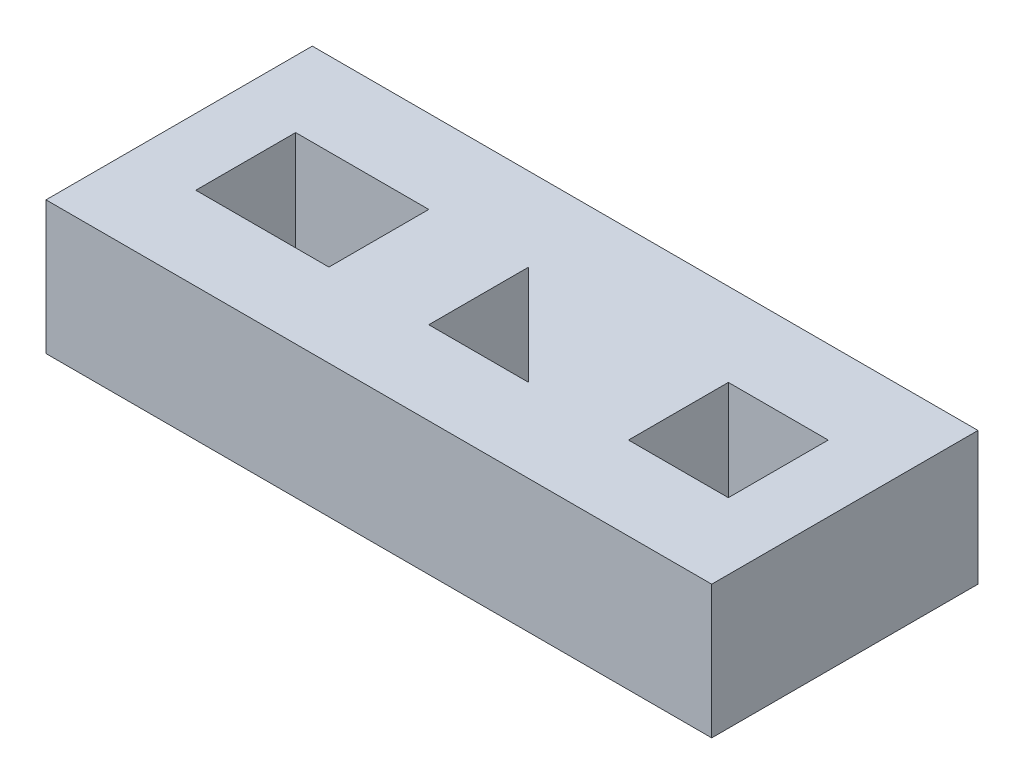
ISO-10303-21;
HEADER;
FILE_DESCRIPTION(('STEP AP214'),'2;1');
FILE_NAME('part.step','',(''),(''),'','','');
FILE_SCHEMA(('AUTOMOTIVE_DESIGN { 1 0 10303 214 1 1 1 1 }'));
ENDSEC;
DATA;
#1=APPLICATION_CONTEXT('core data for automotive mechanical design processes');
#2=APPLICATION_PROTOCOL_DEFINITION('international standard','automotive_design',2000,#1);
#3=PRODUCT_CONTEXT('',#1,'mechanical');
#4=PRODUCT('Part','Part','',(#3));
#5=PRODUCT_RELATED_PRODUCT_CATEGORY('part','',(#4));
#6=PRODUCT_DEFINITION_FORMATION('','',#4);
#7=PRODUCT_DEFINITION_CONTEXT('part definition',#1,'design');
#8=PRODUCT_DEFINITION('design','',#6,#7);
#9=PRODUCT_DEFINITION_SHAPE('','',#8);
#10=(LENGTH_UNIT() NAMED_UNIT(*) SI_UNIT(.MILLI.,.METRE.));
#11=(NAMED_UNIT(*) PLANE_ANGLE_UNIT() SI_UNIT($,.RADIAN.));
#12=(NAMED_UNIT(*) SI_UNIT($,.STERADIAN.) SOLID_ANGLE_UNIT());
#13=UNCERTAINTY_MEASURE_WITH_UNIT(LENGTH_MEASURE(1.E-05),#10,'distance_accuracy_value','');
#14=(GEOMETRIC_REPRESENTATION_CONTEXT(3) GLOBAL_UNCERTAINTY_ASSIGNED_CONTEXT((#13)) GLOBAL_UNIT_ASSIGNED_CONTEXT((#10,
#11,#12)) REPRESENTATION_CONTEXT('',''));
#15=CARTESIAN_POINT('',(0.,0.,0.));
#16=DIRECTION('',(0.,0.,1.));
#17=DIRECTION('',(1.,0.,0.));
#18=AXIS2_PLACEMENT_3D('',#15,#16,#17);
#19=CARTESIAN_POINT('',(0.,25.4,0.));
#20=DIRECTION('',(1.,0.,0.));
#21=DIRECTION('',(0.,0.,-1.));
#22=AXIS2_PLACEMENT_3D('',#19,#20,#21);
#23=PLANE('',#22);
#24=DIRECTION('',(0.,0.,1.));
#25=VECTOR('',#24,1.);
#26=CARTESIAN_POINT('',(0.,0.,0.));
#27=LINE('',#26,#25);
#28=CARTESIAN_POINT('',(0.,0.,-50.8));
#29=VERTEX_POINT('',#28);
#30=CARTESIAN_POINT('',(0.,0.,0.));
#31=VERTEX_POINT('',#30);
#32=EDGE_CURVE('E224',#29,#31,#27,.T.);
#33=ORIENTED_EDGE('',*,*,#32,.T.);
#34=DIRECTION('',(0.,-1.,0.));
#35=VECTOR('',#34,1.);
#36=CARTESIAN_POINT('',(0.,25.4,0.));
#37=LINE('',#36,#35);
#38=CARTESIAN_POINT('',(0.,25.4,0.));
#39=VERTEX_POINT('',#38);
#40=EDGE_CURVE('E11',#39,#31,#37,.T.);
#41=ORIENTED_EDGE('',*,*,#40,.F.);
#42=DIRECTION('',(0.,0.,1.));
#43=VECTOR('',#42,1.);
#44=CARTESIAN_POINT('',(0.,25.4,0.));
#45=LINE('',#44,#43);
#46=CARTESIAN_POINT('',(0.,25.4,-50.8));
#47=VERTEX_POINT('',#46);
#48=EDGE_CURVE('E231',#47,#39,#45,.T.);
#49=ORIENTED_EDGE('',*,*,#48,.F.);
#50=DIRECTION('',(0.,-1.,0.));
#51=VECTOR('',#50,1.);
#52=CARTESIAN_POINT('',(0.,25.4,-50.8));
#53=LINE('',#52,#51);
#54=EDGE_CURVE('E241',#47,#29,#53,.T.);
#55=ORIENTED_EDGE('',*,*,#54,.T.);
#56=EDGE_LOOP('',(#33,#41,#49,#55));
#57=FACE_BOUND('',#56,.T.);
#58=ADVANCED_FACE('F33',(#57),#23,.F.);
#59=CARTESIAN_POINT('',(0.,25.4,0.));
#60=DIRECTION('',(0.,0.,-1.));
#61=DIRECTION('',(-1.,0.,0.));
#62=AXIS2_PLACEMENT_3D('',#59,#60,#61);
#63=PLANE('',#62);
#64=DIRECTION('',(1.,0.,0.));
#65=VECTOR('',#64,1.);
#66=CARTESIAN_POINT('',(0.,0.,0.));
#67=LINE('',#66,#65);
#68=CARTESIAN_POINT('',(127.,0.,0.));
#69=VERTEX_POINT('',#68);
#70=EDGE_CURVE('E244',#31,#69,#67,.T.);
#71=ORIENTED_EDGE('',*,*,#70,.T.);
#72=DIRECTION('',(0.,-1.,0.));
#73=VECTOR('',#72,1.);
#74=CARTESIAN_POINT('',(127.,25.4,0.));
#75=LINE('',#74,#73);
#76=CARTESIAN_POINT('',(127.,25.4,0.));
#77=VERTEX_POINT('',#76);
#78=EDGE_CURVE('E40',#77,#69,#75,.T.);
#79=ORIENTED_EDGE('',*,*,#78,.F.);
#80=DIRECTION('',(1.,0.,0.));
#81=VECTOR('',#80,1.);
#82=CARTESIAN_POINT('',(0.,25.4,0.));
#83=LINE('',#82,#81);
#84=EDGE_CURVE('E234',#39,#77,#83,.T.);
#85=ORIENTED_EDGE('',*,*,#84,.F.);
#86=ORIENTED_EDGE('',*,*,#40,.T.);
#87=EDGE_LOOP('',(#71,#79,#85,#86));
#88=FACE_BOUND('',#87,.T.);
#89=ADVANCED_FACE('F273',(#88),#63,.F.);
#90=CARTESIAN_POINT('',(127.,25.4,0.));
#91=DIRECTION('',(-1.,0.,0.));
#92=DIRECTION('',(0.,0.,1.));
#93=AXIS2_PLACEMENT_3D('',#90,#91,#92);
#94=PLANE('',#93);
#95=DIRECTION('',(0.,0.,-1.));
#96=VECTOR('',#95,1.);
#97=CARTESIAN_POINT('',(127.,0.,0.));
#98=LINE('',#97,#96);
#99=CARTESIAN_POINT('',(127.,0.,-50.8));
#100=VERTEX_POINT('',#99);
#101=EDGE_CURVE('E246',#69,#100,#98,.T.);
#102=ORIENTED_EDGE('',*,*,#101,.T.);
#103=DIRECTION('',(0.,-1.,0.));
#104=VECTOR('',#103,1.);
#105=CARTESIAN_POINT('',(127.,25.4,-50.8));
#106=LINE('',#105,#104);
#107=CARTESIAN_POINT('',(127.,25.4,-50.8));
#108=VERTEX_POINT('',#107);
#109=EDGE_CURVE('E251',#108,#100,#106,.T.);
#110=ORIENTED_EDGE('',*,*,#109,.F.);
#111=DIRECTION('',(0.,0.,-1.));
#112=VECTOR('',#111,1.);
#113=CARTESIAN_POINT('',(127.,25.4,0.));
#114=LINE('',#113,#112);
#115=EDGE_CURVE('E237',#77,#108,#114,.T.);
#116=ORIENTED_EDGE('',*,*,#115,.F.);
#117=ORIENTED_EDGE('',*,*,#78,.T.);
#118=EDGE_LOOP('',(#102,#110,#116,#117));
#119=FACE_BOUND('',#118,.T.);
#120=ADVANCED_FACE('F258',(#119),#94,.F.);
#121=CARTESIAN_POINT('',(0.,25.4,-50.8));
#122=DIRECTION('',(0.,0.,1.));
#123=DIRECTION('',(1.,0.,0.));
#124=AXIS2_PLACEMENT_3D('',#121,#122,#123);
#125=PLANE('',#124);
#126=DIRECTION('',(-1.,0.,0.));
#127=VECTOR('',#126,1.);
#128=CARTESIAN_POINT('',(0.,0.,-50.8));
#129=LINE('',#128,#127);
#130=EDGE_CURVE('E235',#100,#29,#129,.T.);
#131=ORIENTED_EDGE('',*,*,#130,.T.);
#132=ORIENTED_EDGE('',*,*,#54,.F.);
#133=DIRECTION('',(-1.,0.,0.));
#134=VECTOR('',#133,1.);
#135=CARTESIAN_POINT('',(0.,25.4,-50.8));
#136=LINE('',#135,#134);
#137=EDGE_CURVE('E239',#108,#47,#136,.T.);
#138=ORIENTED_EDGE('',*,*,#137,.F.);
#139=ORIENTED_EDGE('',*,*,#109,.T.);
#140=EDGE_LOOP('',(#131,#132,#138,#139));
#141=FACE_BOUND('',#140,.T.);
#142=ADVANCED_FACE('F266',(#141),#125,.F.);
#143=CARTESIAN_POINT('',(0.,25.4,0.));
#144=DIRECTION('',(0.,-1.,0.));
#145=DIRECTION('',(0.,0.,-1.));
#146=AXIS2_PLACEMENT_3D('',#143,#144,#145);
#147=PLANE('',#146);
#148=DIRECTION('',(0.,0.,1.));
#149=VECTOR('',#148,1.);
#150=CARTESIAN_POINT('',(57.15,25.4,-34.925));
#151=LINE('',#150,#149);
#152=CARTESIAN_POINT('',(57.15,25.4,-34.925));
#153=VERTEX_POINT('',#152);
#154=CARTESIAN_POINT('',(57.15,25.4,-15.875));
#155=VERTEX_POINT('',#154);
#156=EDGE_CURVE('E157',#153,#155,#151,.T.);
#157=ORIENTED_EDGE('',*,*,#156,.F.);
#158=DIRECTION('',(-0.707106781186548,0.,-0.707106781186547));
#159=VECTOR('',#158,1.);
#160=CARTESIAN_POINT('',(76.2,25.4,-15.875));
#161=LINE('',#160,#159);
#162=CARTESIAN_POINT('',(76.2,25.4,-15.875));
#163=VERTEX_POINT('',#162);
#164=EDGE_CURVE('E47',#163,#153,#161,.T.);
#165=ORIENTED_EDGE('',*,*,#164,.F.);
#166=DIRECTION('',(1.,0.,0.));
#167=VECTOR('',#166,1.);
#168=CARTESIAN_POINT('',(57.15,25.4,-15.875));
#169=LINE('',#168,#167);
#170=EDGE_CURVE('E154',#155,#163,#169,.T.);
#171=ORIENTED_EDGE('',*,*,#170,.F.);
#172=EDGE_LOOP('',(#157,#165,#171));
#173=FACE_BOUND('',#172,.T.);
#174=DIRECTION('',(1.,0.,0.));
#175=VECTOR('',#174,1.);
#176=CARTESIAN_POINT('',(95.25,25.4,-15.875));
#177=LINE('',#176,#175);
#178=CARTESIAN_POINT('',(95.25,25.4,-15.875));
#179=VERTEX_POINT('',#178);
#180=CARTESIAN_POINT('',(114.3,25.4,-15.875));
#181=VERTEX_POINT('',#180);
#182=EDGE_CURVE('E182',#179,#181,#177,.T.);
#183=ORIENTED_EDGE('',*,*,#182,.F.);
#184=DIRECTION('',(0.,0.,1.));
#185=VECTOR('',#184,1.);
#186=CARTESIAN_POINT('',(95.25,25.4,-15.875));
#187=LINE('',#186,#185);
#188=CARTESIAN_POINT('',(95.25,25.4,-34.925));
#189=VERTEX_POINT('',#188);
#190=EDGE_CURVE('E165',#189,#179,#187,.T.);
#191=ORIENTED_EDGE('',*,*,#190,.F.);
#192=DIRECTION('',(-1.,0.,0.));
#193=VECTOR('',#192,1.);
#194=CARTESIAN_POINT('',(95.25,25.4,-34.925));
#195=LINE('',#194,#193);
#196=CARTESIAN_POINT('',(114.3,25.4,-34.925));
#197=VERTEX_POINT('',#196);
#198=EDGE_CURVE('E171',#197,#189,#195,.T.);
#199=ORIENTED_EDGE('',*,*,#198,.F.);
#200=DIRECTION('',(0.,0.,-1.));
#201=VECTOR('',#200,1.);
#202=CARTESIAN_POINT('',(114.3,25.4,-15.875));
#203=LINE('',#202,#201);
#204=EDGE_CURVE('E185',#181,#197,#203,.T.);
#205=ORIENTED_EDGE('',*,*,#204,.F.);
#206=EDGE_LOOP('',(#183,#191,#199,#205));
#207=FACE_BOUND('',#206,.T.);
#208=DIRECTION('',(1.,0.,0.));
#209=VECTOR('',#208,1.);
#210=CARTESIAN_POINT('',(12.7,25.4,-15.875));
#211=LINE('',#210,#209);
#212=CARTESIAN_POINT('',(12.7,25.4,-15.875));
#213=VERTEX_POINT('',#212);
#214=CARTESIAN_POINT('',(38.1,25.4,-15.875));
#215=VERTEX_POINT('',#214);
#216=EDGE_CURVE('E214',#213,#215,#211,.T.);
#217=ORIENTED_EDGE('',*,*,#216,.F.);
#218=DIRECTION('',(0.,0.,1.));
#219=VECTOR('',#218,1.);
#220=CARTESIAN_POINT('',(12.7,25.4,-15.875));
#221=LINE('',#220,#219);
#222=CARTESIAN_POINT('',(12.7,25.4,-34.925));
#223=VERTEX_POINT('',#222);
#224=EDGE_CURVE('E192',#223,#213,#221,.T.);
#225=ORIENTED_EDGE('',*,*,#224,.F.);
#226=DIRECTION('',(-1.,0.,0.));
#227=VECTOR('',#226,1.);
#228=CARTESIAN_POINT('',(12.7,25.4,-34.925));
#229=LINE('',#228,#227);
#230=CARTESIAN_POINT('',(38.1,25.4,-34.925));
#231=VERTEX_POINT('',#230);
#232=EDGE_CURVE('E203',#231,#223,#229,.T.);
#233=ORIENTED_EDGE('',*,*,#232,.F.);
#234=DIRECTION('',(0.,0.,-1.));
#235=VECTOR('',#234,1.);
#236=CARTESIAN_POINT('',(38.1,25.4,-15.875));
#237=LINE('',#236,#235);
#238=EDGE_CURVE('E217',#215,#231,#237,.T.);
#239=ORIENTED_EDGE('',*,*,#238,.F.);
#240=EDGE_LOOP('',(#217,#225,#233,#239));
#241=FACE_BOUND('',#240,.T.);
#242=ORIENTED_EDGE('',*,*,#48,.T.);
#243=ORIENTED_EDGE('',*,*,#84,.T.);
#244=ORIENTED_EDGE('',*,*,#115,.T.);
#245=ORIENTED_EDGE('',*,*,#137,.T.);
#246=EDGE_LOOP('',(#242,#243,#244,#245));
#247=FACE_BOUND('',#246,.T.);
#248=ADVANCED_FACE('F272',(#173,#207,#241,#247),#147,.F.);
#249=CARTESIAN_POINT('',(0.,0.,0.));
#250=DIRECTION('',(0.,-1.,0.));
#251=DIRECTION('',(0.,0.,-1.));
#252=AXIS2_PLACEMENT_3D('',#249,#250,#251);
#253=PLANE('',#252);
#254=DIRECTION('',(-0.707106781186548,0.,-0.707106781186547));
#255=VECTOR('',#254,1.);
#256=CARTESIAN_POINT('',(76.2,0.,-15.875));
#257=LINE('',#256,#255);
#258=CARTESIAN_POINT('',(76.2,0.,-15.875));
#259=VERTEX_POINT('',#258);
#260=CARTESIAN_POINT('',(57.15,0.,-34.925));
#261=VERTEX_POINT('',#260);
#262=EDGE_CURVE('E141',#259,#261,#257,.T.);
#263=ORIENTED_EDGE('',*,*,#262,.T.);
#264=DIRECTION('',(0.,0.,1.));
#265=VECTOR('',#264,1.);
#266=CARTESIAN_POINT('',(57.15,0.,-34.925));
#267=LINE('',#266,#265);
#268=CARTESIAN_POINT('',(57.15,0.,-15.875));
#269=VERTEX_POINT('',#268);
#270=EDGE_CURVE('E148',#261,#269,#267,.T.);
#271=ORIENTED_EDGE('',*,*,#270,.T.);
#272=DIRECTION('',(1.,0.,0.));
#273=VECTOR('',#272,1.);
#274=CARTESIAN_POINT('',(57.15,0.,-15.875));
#275=LINE('',#274,#273);
#276=EDGE_CURVE('E55',#269,#259,#275,.T.);
#277=ORIENTED_EDGE('',*,*,#276,.T.);
#278=EDGE_LOOP('',(#263,#271,#277));
#279=FACE_BOUND('',#278,.T.);
#280=DIRECTION('',(0.,0.,1.));
#281=VECTOR('',#280,1.);
#282=CARTESIAN_POINT('',(95.25,0.,-15.875));
#283=LINE('',#282,#281);
#284=CARTESIAN_POINT('',(95.25,0.,-34.925));
#285=VERTEX_POINT('',#284);
#286=CARTESIAN_POINT('',(95.25,0.,-15.875));
#287=VERTEX_POINT('',#286);
#288=EDGE_CURVE('E167',#285,#287,#283,.T.);
#289=ORIENTED_EDGE('',*,*,#288,.T.);
#290=DIRECTION('',(1.,0.,0.));
#291=VECTOR('',#290,1.);
#292=CARTESIAN_POINT('',(95.25,0.,-15.875));
#293=LINE('',#292,#291);
#294=CARTESIAN_POINT('',(114.3,0.,-15.875));
#295=VERTEX_POINT('',#294);
#296=EDGE_CURVE('E170',#287,#295,#293,.T.);
#297=ORIENTED_EDGE('',*,*,#296,.T.);
#298=DIRECTION('',(0.,0.,-1.));
#299=VECTOR('',#298,1.);
#300=CARTESIAN_POINT('',(114.3,0.,-15.875));
#301=LINE('',#300,#299);
#302=CARTESIAN_POINT('',(114.3,0.,-34.925));
#303=VERTEX_POINT('',#302);
#304=EDGE_CURVE('E174',#295,#303,#301,.T.);
#305=ORIENTED_EDGE('',*,*,#304,.T.);
#306=DIRECTION('',(-1.,0.,0.));
#307=VECTOR('',#306,1.);
#308=CARTESIAN_POINT('',(95.25,0.,-34.925));
#309=LINE('',#308,#307);
#310=EDGE_CURVE('E177',#303,#285,#309,.T.);
#311=ORIENTED_EDGE('',*,*,#310,.T.);
#312=EDGE_LOOP('',(#289,#297,#305,#311));
#313=FACE_BOUND('',#312,.T.);
#314=DIRECTION('',(0.,0.,1.));
#315=VECTOR('',#314,1.);
#316=CARTESIAN_POINT('',(12.7,0.,-15.875));
#317=LINE('',#316,#315);
#318=CARTESIAN_POINT('',(12.7,0.,-34.925));
#319=VERTEX_POINT('',#318);
#320=CARTESIAN_POINT('',(12.7,0.,-15.875));
#321=VERTEX_POINT('',#320);
#322=EDGE_CURVE('E199',#319,#321,#317,.T.);
#323=ORIENTED_EDGE('',*,*,#322,.T.);
#324=DIRECTION('',(1.,0.,0.));
#325=VECTOR('',#324,1.);
#326=CARTESIAN_POINT('',(12.7,0.,-15.875));
#327=LINE('',#326,#325);
#328=CARTESIAN_POINT('',(38.1,0.,-15.875));
#329=VERTEX_POINT('',#328);
#330=EDGE_CURVE('E202',#321,#329,#327,.T.);
#331=ORIENTED_EDGE('',*,*,#330,.T.);
#332=DIRECTION('',(0.,0.,-1.));
#333=VECTOR('',#332,1.);
#334=CARTESIAN_POINT('',(38.1,0.,-15.875));
#335=LINE('',#334,#333);
#336=CARTESIAN_POINT('',(38.1,0.,-34.925));
#337=VERTEX_POINT('',#336);
#338=EDGE_CURVE('E206',#329,#337,#335,.T.);
#339=ORIENTED_EDGE('',*,*,#338,.T.);
#340=DIRECTION('',(-1.,0.,0.));
#341=VECTOR('',#340,1.);
#342=CARTESIAN_POINT('',(12.7,0.,-34.925));
#343=LINE('',#342,#341);
#344=EDGE_CURVE('E209',#337,#319,#343,.T.);
#345=ORIENTED_EDGE('',*,*,#344,.T.);
#346=EDGE_LOOP('',(#323,#331,#339,#345));
#347=FACE_BOUND('',#346,.T.);
#348=ORIENTED_EDGE('',*,*,#32,.F.);
#349=ORIENTED_EDGE('',*,*,#130,.F.);
#350=ORIENTED_EDGE('',*,*,#101,.F.);
#351=ORIENTED_EDGE('',*,*,#70,.F.);
#352=EDGE_LOOP('',(#348,#349,#350,#351));
#353=FACE_BOUND('',#352,.T.);
#354=ADVANCED_FACE('F152',(#279,#313,#347,#353),#253,.T.);
#355=CARTESIAN_POINT('',(12.7,0.,-15.875));
#356=DIRECTION('',(-1.,0.,0.));
#357=DIRECTION('',(0.,0.,1.));
#358=AXIS2_PLACEMENT_3D('',#355,#356,#357);
#359=PLANE('',#358);
#360=ORIENTED_EDGE('',*,*,#224,.T.);
#361=DIRECTION('',(0.,1.,0.));
#362=VECTOR('',#361,1.);
#363=CARTESIAN_POINT('',(12.7,0.,-15.875));
#364=LINE('',#363,#362);
#365=EDGE_CURVE('E212',#321,#213,#364,.T.);
#366=ORIENTED_EDGE('',*,*,#365,.F.);
#367=ORIENTED_EDGE('',*,*,#322,.F.);
#368=DIRECTION('',(0.,1.,0.));
#369=VECTOR('',#368,1.);
#370=CARTESIAN_POINT('',(12.7,0.,-34.925));
#371=LINE('',#370,#369);
#372=EDGE_CURVE('E222',#319,#223,#371,.T.);
#373=ORIENTED_EDGE('',*,*,#372,.T.);
#374=EDGE_LOOP('',(#360,#366,#367,#373));
#375=FACE_BOUND('',#374,.T.);
#376=ADVANCED_FACE('F285',(#375),#359,.F.);
#377=CARTESIAN_POINT('',(12.7,0.,-34.925));
#378=DIRECTION('',(0.,0.,-1.));
#379=DIRECTION('',(-1.,0.,0.));
#380=AXIS2_PLACEMENT_3D('',#377,#378,#379);
#381=PLANE('',#380);
#382=ORIENTED_EDGE('',*,*,#232,.T.);
#383=ORIENTED_EDGE('',*,*,#372,.F.);
#384=ORIENTED_EDGE('',*,*,#344,.F.);
#385=DIRECTION('',(0.,1.,0.));
#386=VECTOR('',#385,1.);
#387=CARTESIAN_POINT('',(38.1,0.,-34.925));
#388=LINE('',#387,#386);
#389=EDGE_CURVE('E225',#337,#231,#388,.T.);
#390=ORIENTED_EDGE('',*,*,#389,.T.);
#391=EDGE_LOOP('',(#382,#383,#384,#390));
#392=FACE_BOUND('',#391,.T.);
#393=ADVANCED_FACE('F291',(#392),#381,.F.);
#394=CARTESIAN_POINT('',(38.1,0.,-15.875));
#395=DIRECTION('',(1.,0.,0.));
#396=DIRECTION('',(0.,0.,-1.));
#397=AXIS2_PLACEMENT_3D('',#394,#395,#396);
#398=PLANE('',#397);
#399=ORIENTED_EDGE('',*,*,#238,.T.);
#400=ORIENTED_EDGE('',*,*,#389,.F.);
#401=ORIENTED_EDGE('',*,*,#338,.F.);
#402=DIRECTION('',(0.,1.,0.));
#403=VECTOR('',#402,1.);
#404=CARTESIAN_POINT('',(38.1,0.,-15.875));
#405=LINE('',#404,#403);
#406=EDGE_CURVE('E227',#329,#215,#405,.T.);
#407=ORIENTED_EDGE('',*,*,#406,.T.);
#408=EDGE_LOOP('',(#399,#400,#401,#407));
#409=FACE_BOUND('',#408,.T.);
#410=ADVANCED_FACE('F297',(#409),#398,.F.);
#411=CARTESIAN_POINT('',(12.7,0.,-15.875));
#412=DIRECTION('',(0.,0.,1.));
#413=DIRECTION('',(1.,0.,0.));
#414=AXIS2_PLACEMENT_3D('',#411,#412,#413);
#415=PLANE('',#414);
#416=ORIENTED_EDGE('',*,*,#216,.T.);
#417=ORIENTED_EDGE('',*,*,#406,.F.);
#418=ORIENTED_EDGE('',*,*,#330,.F.);
#419=ORIENTED_EDGE('',*,*,#365,.T.);
#420=EDGE_LOOP('',(#416,#417,#418,#419));
#421=FACE_BOUND('',#420,.T.);
#422=ADVANCED_FACE('F293',(#421),#415,.F.);
#423=CARTESIAN_POINT('',(95.25,0.,-15.875));
#424=DIRECTION('',(-1.,0.,0.));
#425=DIRECTION('',(0.,0.,1.));
#426=AXIS2_PLACEMENT_3D('',#423,#424,#425);
#427=PLANE('',#426);
#428=ORIENTED_EDGE('',*,*,#190,.T.);
#429=DIRECTION('',(0.,1.,0.));
#430=VECTOR('',#429,1.);
#431=CARTESIAN_POINT('',(95.25,0.,-15.875));
#432=LINE('',#431,#430);
#433=EDGE_CURVE('E180',#287,#179,#432,.T.);
#434=ORIENTED_EDGE('',*,*,#433,.F.);
#435=ORIENTED_EDGE('',*,*,#288,.F.);
#436=DIRECTION('',(0.,1.,0.));
#437=VECTOR('',#436,1.);
#438=CARTESIAN_POINT('',(95.25,0.,-34.925));
#439=LINE('',#438,#437);
#440=EDGE_CURVE('E190',#285,#189,#439,.T.);
#441=ORIENTED_EDGE('',*,*,#440,.T.);
#442=EDGE_LOOP('',(#428,#434,#435,#441));
#443=FACE_BOUND('',#442,.T.);
#444=ADVANCED_FACE('F296',(#443),#427,.F.);
#445=CARTESIAN_POINT('',(95.25,0.,-34.925));
#446=DIRECTION('',(0.,0.,-1.));
#447=DIRECTION('',(-1.,0.,0.));
#448=AXIS2_PLACEMENT_3D('',#445,#446,#447);
#449=PLANE('',#448);
#450=ORIENTED_EDGE('',*,*,#198,.T.);
#451=ORIENTED_EDGE('',*,*,#440,.F.);
#452=ORIENTED_EDGE('',*,*,#310,.F.);
#453=DIRECTION('',(0.,1.,0.));
#454=VECTOR('',#453,1.);
#455=CARTESIAN_POINT('',(114.3,0.,-34.925));
#456=LINE('',#455,#454);
#457=EDGE_CURVE('E193',#303,#197,#456,.T.);
#458=ORIENTED_EDGE('',*,*,#457,.T.);
#459=EDGE_LOOP('',(#450,#451,#452,#458));
#460=FACE_BOUND('',#459,.T.);
#461=ADVANCED_FACE('F307',(#460),#449,.F.);
#462=CARTESIAN_POINT('',(114.3,0.,-15.875));
#463=DIRECTION('',(1.,0.,0.));
#464=DIRECTION('',(0.,0.,-1.));
#465=AXIS2_PLACEMENT_3D('',#462,#463,#464);
#466=PLANE('',#465);
#467=ORIENTED_EDGE('',*,*,#204,.T.);
#468=ORIENTED_EDGE('',*,*,#457,.F.);
#469=ORIENTED_EDGE('',*,*,#304,.F.);
#470=DIRECTION('',(0.,1.,0.));
#471=VECTOR('',#470,1.);
#472=CARTESIAN_POINT('',(114.3,0.,-15.875));
#473=LINE('',#472,#471);
#474=EDGE_CURVE('E195',#295,#181,#473,.T.);
#475=ORIENTED_EDGE('',*,*,#474,.T.);
#476=EDGE_LOOP('',(#467,#468,#469,#475));
#477=FACE_BOUND('',#476,.T.);
#478=ADVANCED_FACE('F312',(#477),#466,.F.);
#479=CARTESIAN_POINT('',(95.25,0.,-15.875));
#480=DIRECTION('',(0.,0.,1.));
#481=DIRECTION('',(1.,0.,0.));
#482=AXIS2_PLACEMENT_3D('',#479,#480,#481);
#483=PLANE('',#482);
#484=ORIENTED_EDGE('',*,*,#182,.T.);
#485=ORIENTED_EDGE('',*,*,#474,.F.);
#486=ORIENTED_EDGE('',*,*,#296,.F.);
#487=ORIENTED_EDGE('',*,*,#433,.T.);
#488=EDGE_LOOP('',(#484,#485,#486,#487));
#489=FACE_BOUND('',#488,.T.);
#490=ADVANCED_FACE('F309',(#489),#483,.F.);
#491=CARTESIAN_POINT('',(76.2,0.,-15.875));
#492=DIRECTION('',(0.707106781186547,0.,-0.707106781186548));
#493=DIRECTION('',(-0.707106781186548,0.,-0.707106781186547));
#494=AXIS2_PLACEMENT_3D('',#491,#492,#493);
#495=PLANE('',#494);
#496=ORIENTED_EDGE('',*,*,#164,.T.);
#497=DIRECTION('',(0.,1.,0.));
#498=VECTOR('',#497,1.);
#499=CARTESIAN_POINT('',(57.15,0.,-34.925));
#500=LINE('',#499,#498);
#501=EDGE_CURVE('E137',#261,#153,#500,.T.);
#502=ORIENTED_EDGE('',*,*,#501,.F.);
#503=ORIENTED_EDGE('',*,*,#262,.F.);
#504=DIRECTION('',(0.,1.,0.));
#505=VECTOR('',#504,1.);
#506=CARTESIAN_POINT('',(76.2,0.,-15.875));
#507=LINE('',#506,#505);
#508=EDGE_CURVE('E163',#259,#163,#507,.T.);
#509=ORIENTED_EDGE('',*,*,#508,.T.);
#510=EDGE_LOOP('',(#496,#502,#503,#509));
#511=FACE_BOUND('',#510,.T.);
#512=ADVANCED_FACE('F139',(#511),#495,.F.);
#513=CARTESIAN_POINT('',(57.15,0.,-15.875));
#514=DIRECTION('',(0.,0.,1.));
#515=DIRECTION('',(1.,0.,0.));
#516=AXIS2_PLACEMENT_3D('',#513,#514,#515);
#517=PLANE('',#516);
#518=ORIENTED_EDGE('',*,*,#170,.T.);
#519=ORIENTED_EDGE('',*,*,#508,.F.);
#520=ORIENTED_EDGE('',*,*,#276,.F.);
#521=DIRECTION('',(0.,1.,0.));
#522=VECTOR('',#521,1.);
#523=CARTESIAN_POINT('',(57.15,0.,-15.875));
#524=LINE('',#523,#522);
#525=EDGE_CURVE('E145',#269,#155,#524,.T.);
#526=ORIENTED_EDGE('',*,*,#525,.T.);
#527=EDGE_LOOP('',(#518,#519,#520,#526));
#528=FACE_BOUND('',#527,.T.);
#529=ADVANCED_FACE('F322',(#528),#517,.F.);
#530=CARTESIAN_POINT('',(57.15,0.,-34.925));
#531=DIRECTION('',(-1.,0.,0.));
#532=DIRECTION('',(0.,0.,1.));
#533=AXIS2_PLACEMENT_3D('',#530,#531,#532);
#534=PLANE('',#533);
#535=ORIENTED_EDGE('',*,*,#156,.T.);
#536=ORIENTED_EDGE('',*,*,#525,.F.);
#537=ORIENTED_EDGE('',*,*,#270,.F.);
#538=ORIENTED_EDGE('',*,*,#501,.T.);
#539=EDGE_LOOP('',(#535,#536,#537,#538));
#540=FACE_BOUND('',#539,.T.);
#541=ADVANCED_FACE('F149',(#540),#534,.F.);
#542=CLOSED_SHELL('',(#58,#89,#120,#142,#248,#354,#376,#393,#410,#422,#444,#461,#478,#490,#512,
#529,#541));
#543=MANIFOLD_SOLID_BREP('B2',#542);
#544=ADVANCED_BREP_SHAPE_REPRESENTATION('',(#18,#543),#14);
#545=SHAPE_DEFINITION_REPRESENTATION(#9,#544);
ENDSEC;
END-ISO-10303-21;
